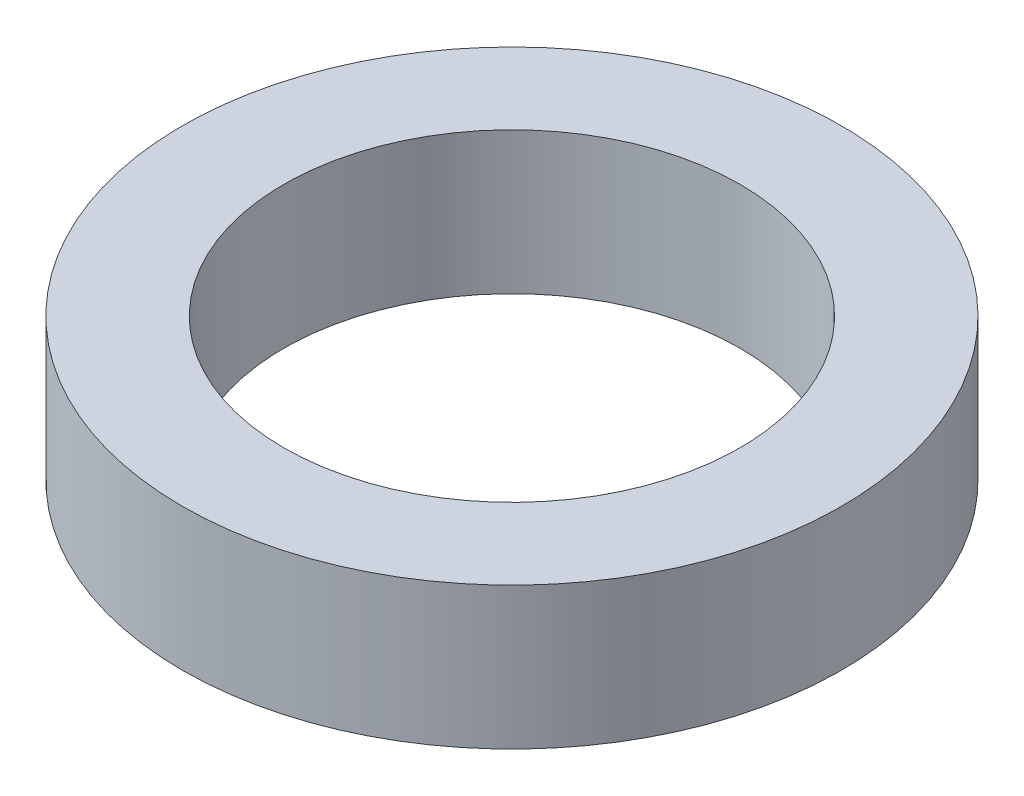
ISO-10303-21;
HEADER;
FILE_DESCRIPTION(('STEP AP214'),'2;1');
FILE_NAME('part.step','',(''),(''),'','','');
FILE_SCHEMA(('AUTOMOTIVE_DESIGN { 1 0 10303 214 1 1 1 1 }'));
ENDSEC;
DATA;
#1=APPLICATION_CONTEXT('core data for automotive mechanical design processes');
#2=APPLICATION_PROTOCOL_DEFINITION('international standard','automotive_design',2000,#1);
#3=PRODUCT_CONTEXT('',#1,'mechanical');
#4=PRODUCT('Part','Part','',(#3));
#5=PRODUCT_RELATED_PRODUCT_CATEGORY('part','',(#4));
#6=PRODUCT_DEFINITION_FORMATION('','',#4);
#7=PRODUCT_DEFINITION_CONTEXT('part definition',#1,'design');
#8=PRODUCT_DEFINITION('design','',#6,#7);
#9=PRODUCT_DEFINITION_SHAPE('','',#8);
#10=(LENGTH_UNIT() NAMED_UNIT(*) SI_UNIT(.MILLI.,.METRE.));
#11=(NAMED_UNIT(*) PLANE_ANGLE_UNIT() SI_UNIT($,.RADIAN.));
#12=(NAMED_UNIT(*) SI_UNIT($,.STERADIAN.) SOLID_ANGLE_UNIT());
#13=UNCERTAINTY_MEASURE_WITH_UNIT(LENGTH_MEASURE(1.E-05),#10,'distance_accuracy_value','');
#14=(GEOMETRIC_REPRESENTATION_CONTEXT(3) GLOBAL_UNCERTAINTY_ASSIGNED_CONTEXT((#13)) GLOBAL_UNIT_ASSIGNED_CONTEXT((#10,
#11,#12)) REPRESENTATION_CONTEXT('',''));
#15=CARTESIAN_POINT('',(0.,0.,0.));
#16=DIRECTION('',(0.,0.,1.));
#17=DIRECTION('',(1.,0.,0.));
#18=AXIS2_PLACEMENT_3D('',#15,#16,#17);
#19=CARTESIAN_POINT('',(0.,28.,0.));
#20=DIRECTION('',(0.,-1.,0.));
#21=DIRECTION('',(0.,0.,-1.));
#22=AXIS2_PLACEMENT_3D('',#19,#20,#21);
#23=CYLINDRICAL_SURFACE('',#22,65.);
#24=CARTESIAN_POINT('',(0.,28.,0.));
#25=DIRECTION('',(0.,1.,0.));
#26=DIRECTION('',(0.,0.,1.));
#27=AXIS2_PLACEMENT_3D('',#24,#25,#26);
#28=CIRCLE('',#27,65.);
#29=CARTESIAN_POINT('',(0.,28.,65.));
#30=VERTEX_POINT('',#29);
#31=EDGE_CURVE('E10',#30,#30,#28,.T.);
#32=ORIENTED_EDGE('',*,*,#31,.F.);
#33=EDGE_LOOP('',(#32));
#34=FACE_BOUND('',#33,.T.);
#35=CARTESIAN_POINT('',(0.,0.,0.));
#36=DIRECTION('',(0.,1.,0.));
#37=DIRECTION('',(0.,0.,1.));
#38=AXIS2_PLACEMENT_3D('',#35,#36,#37);
#39=CIRCLE('',#38,65.);
#40=CARTESIAN_POINT('',(0.,0.,65.));
#41=VERTEX_POINT('',#40);
#42=EDGE_CURVE('E37',#41,#41,#39,.T.);
#43=ORIENTED_EDGE('',*,*,#42,.T.);
#44=EDGE_LOOP('',(#43));
#45=FACE_BOUND('',#44,.T.);
#46=ADVANCED_FACE('F40',(#34,#45),#23,.T.);
#47=CARTESIAN_POINT('',(0.,28.,0.));
#48=DIRECTION('',(0.,1.,0.));
#49=DIRECTION('',(0.,0.,1.));
#50=AXIS2_PLACEMENT_3D('',#47,#48,#49);
#51=PLANE('',#50);
#52=CARTESIAN_POINT('',(0.,28.,0.));
#53=DIRECTION('',(0.,1.,0.));
#54=DIRECTION('',(0.,0.,1.));
#55=AXIS2_PLACEMENT_3D('',#52,#53,#54);
#56=CIRCLE('',#55,45.);
#57=CARTESIAN_POINT('',(0.,28.,45.));
#58=VERTEX_POINT('',#57);
#59=EDGE_CURVE('E50',#58,#58,#56,.T.);
#60=ORIENTED_EDGE('',*,*,#59,.F.);
#61=EDGE_LOOP('',(#60));
#62=FACE_BOUND('',#61,.T.);
#63=ORIENTED_EDGE('',*,*,#31,.T.);
#64=EDGE_LOOP('',(#63));
#65=FACE_BOUND('',#64,.T.);
#66=ADVANCED_FACE('F59',(#62,#65),#51,.T.);
#67=CARTESIAN_POINT('',(0.,0.,0.));
#68=DIRECTION('',(0.,1.,0.));
#69=DIRECTION('',(0.,0.,1.));
#70=AXIS2_PLACEMENT_3D('',#67,#68,#69);
#71=PLANE('',#70);
#72=CARTESIAN_POINT('',(0.,0.,0.));
#73=DIRECTION('',(0.,1.,0.));
#74=DIRECTION('',(0.,0.,1.));
#75=AXIS2_PLACEMENT_3D('',#72,#73,#74);
#76=CIRCLE('',#75,45.);
#77=CARTESIAN_POINT('',(0.,0.,45.));
#78=VERTEX_POINT('',#77);
#79=EDGE_CURVE('E47',#78,#78,#76,.T.);
#80=ORIENTED_EDGE('',*,*,#79,.T.);
#81=EDGE_LOOP('',(#80));
#82=FACE_BOUND('',#81,.T.);
#83=ORIENTED_EDGE('',*,*,#42,.F.);
#84=EDGE_LOOP('',(#83));
#85=FACE_BOUND('',#84,.T.);
#86=ADVANCED_FACE('F58',(#82,#85),#71,.F.);
#87=CARTESIAN_POINT('',(0.,28.,0.));
#88=DIRECTION('',(0.,-1.,0.));
#89=DIRECTION('',(0.,0.,-1.));
#90=AXIS2_PLACEMENT_3D('',#87,#88,#89);
#91=CYLINDRICAL_SURFACE('',#90,45.);
#92=ORIENTED_EDGE('',*,*,#59,.T.);
#93=EDGE_LOOP('',(#92));
#94=FACE_BOUND('',#93,.T.);
#95=ORIENTED_EDGE('',*,*,#79,.F.);
#96=EDGE_LOOP('',(#95));
#97=FACE_BOUND('',#96,.T.);
#98=ADVANCED_FACE('F54',(#94,#97),#91,.F.);
#99=CLOSED_SHELL('',(#46,#66,#86,#98));
#100=MANIFOLD_SOLID_BREP('B2',#99);
#101=ADVANCED_BREP_SHAPE_REPRESENTATION('',(#18,#100),#14);
#102=SHAPE_DEFINITION_REPRESENTATION(#9,#101);
ENDSEC;
END-ISO-10303-21;
